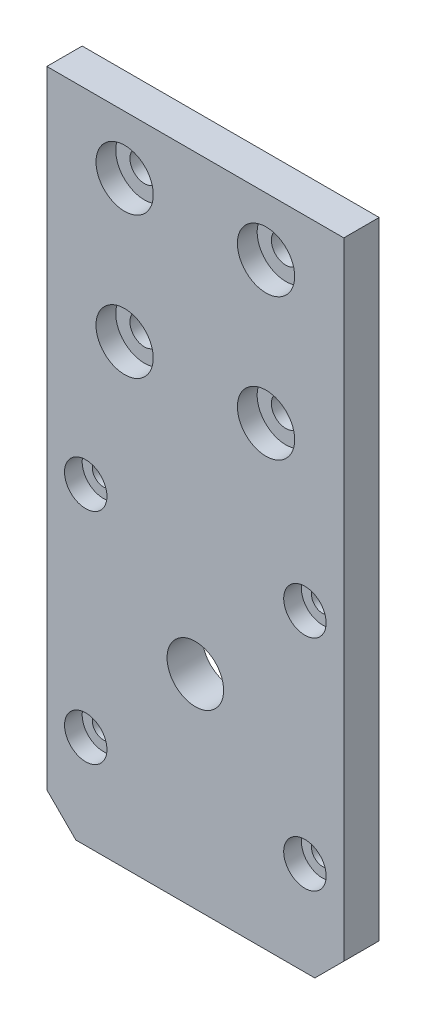
ISO-10303-21;
HEADER;
FILE_DESCRIPTION(('STEP AP214'),'2;1');
FILE_NAME('part.step','',(''),(''),'','','');
FILE_SCHEMA(('AUTOMOTIVE_DESIGN { 1 0 10303 214 1 1 1 1 }'));
ENDSEC;
DATA;
#1=APPLICATION_CONTEXT('core data for automotive mechanical design processes');
#2=APPLICATION_PROTOCOL_DEFINITION('international standard','automotive_design',2000,#1);
#3=PRODUCT_CONTEXT('',#1,'mechanical');
#4=PRODUCT('Part','Part','',(#3));
#5=PRODUCT_RELATED_PRODUCT_CATEGORY('part','',(#4));
#6=PRODUCT_DEFINITION_FORMATION('','',#4);
#7=PRODUCT_DEFINITION_CONTEXT('part definition',#1,'design');
#8=PRODUCT_DEFINITION('design','',#6,#7);
#9=PRODUCT_DEFINITION_SHAPE('','',#8);
#10=(LENGTH_UNIT() NAMED_UNIT(*) SI_UNIT(.MILLI.,.METRE.));
#11=(NAMED_UNIT(*) PLANE_ANGLE_UNIT() SI_UNIT($,.RADIAN.));
#12=(NAMED_UNIT(*) SI_UNIT($,.STERADIAN.) SOLID_ANGLE_UNIT());
#13=UNCERTAINTY_MEASURE_WITH_UNIT(LENGTH_MEASURE(1.E-05),#10,'distance_accuracy_value','');
#14=(GEOMETRIC_REPRESENTATION_CONTEXT(3) GLOBAL_UNCERTAINTY_ASSIGNED_CONTEXT((#13)) GLOBAL_UNIT_ASSIGNED_CONTEXT((#10,
#11,#12)) REPRESENTATION_CONTEXT('',''));
#15=CARTESIAN_POINT('',(0.,0.,0.));
#16=DIRECTION('',(0.,0.,1.));
#17=DIRECTION('',(1.,0.,0.));
#18=AXIS2_PLACEMENT_3D('',#15,#16,#17);
#19=CARTESIAN_POINT('',(5.50000000000001,5.58,0.));
#20=DIRECTION('',(0.,0.,1.));
#21=DIRECTION('',(1.,0.,0.));
#22=AXIS2_PLACEMENT_3D('',#19,#20,#21);
#23=CYLINDRICAL_SURFACE('',#22,1.575);
#24=CARTESIAN_POINT('',(5.50000000000001,5.58,0.));
#25=DIRECTION('',(0.,0.,1.));
#26=DIRECTION('',(1.,0.,0.));
#27=AXIS2_PLACEMENT_3D('',#24,#25,#26);
#28=CIRCLE('',#27,1.575);
#29=CARTESIAN_POINT('',(7.07500000000001,5.58,0.));
#30=VERTEX_POINT('',#29);
#31=EDGE_CURVE('E225',#30,#30,#28,.T.);
#32=ORIENTED_EDGE('',*,*,#31,.F.);
#33=EDGE_LOOP('',(#32));
#34=FACE_BOUND('',#33,.T.);
#35=CARTESIAN_POINT('',(5.50000000000001,5.58,2.5));
#36=DIRECTION('',(0.,0.,1.));
#37=DIRECTION('',(1.,0.,0.));
#38=AXIS2_PLACEMENT_3D('',#35,#36,#37);
#39=CIRCLE('',#38,1.575);
#40=CARTESIAN_POINT('',(7.07500000000001,5.58,2.5));
#41=VERTEX_POINT('',#40);
#42=EDGE_CURVE('E155',#41,#41,#39,.F.);
#43=ORIENTED_EDGE('',*,*,#42,.F.);
#44=EDGE_LOOP('',(#43));
#45=FACE_BOUND('',#44,.T.);
#46=ADVANCED_FACE('F35',(#34,#45),#23,.F.);
#47=CARTESIAN_POINT('',(36.5,5.58000000000001,0.));
#48=DIRECTION('',(0.,0.,1.));
#49=DIRECTION('',(1.,0.,0.));
#50=AXIS2_PLACEMENT_3D('',#47,#48,#49);
#51=CYLINDRICAL_SURFACE('',#50,1.575);
#52=CARTESIAN_POINT('',(36.5,5.58000000000001,0.));
#53=DIRECTION('',(0.,0.,1.));
#54=DIRECTION('',(1.,0.,0.));
#55=AXIS2_PLACEMENT_3D('',#52,#53,#54);
#56=CIRCLE('',#55,1.575);
#57=CARTESIAN_POINT('',(38.075,5.58000000000001,0.));
#58=VERTEX_POINT('',#57);
#59=EDGE_CURVE('E222',#58,#58,#56,.T.);
#60=ORIENTED_EDGE('',*,*,#59,.F.);
#61=EDGE_LOOP('',(#60));
#62=FACE_BOUND('',#61,.T.);
#63=CARTESIAN_POINT('',(36.5,5.58000000000001,2.5));
#64=DIRECTION('',(0.,0.,1.));
#65=DIRECTION('',(1.,0.,0.));
#66=AXIS2_PLACEMENT_3D('',#63,#64,#65);
#67=CIRCLE('',#66,1.575);
#68=CARTESIAN_POINT('',(38.075,5.58000000000001,2.5));
#69=VERTEX_POINT('',#68);
#70=EDGE_CURVE('E150',#69,#69,#67,.F.);
#71=ORIENTED_EDGE('',*,*,#70,.F.);
#72=EDGE_LOOP('',(#71));
#73=FACE_BOUND('',#72,.T.);
#74=ADVANCED_FACE('F296',(#62,#73),#51,.F.);
#75=CARTESIAN_POINT('',(36.5,36.58,0.));
#76=DIRECTION('',(0.,0.,1.));
#77=DIRECTION('',(1.,0.,0.));
#78=AXIS2_PLACEMENT_3D('',#75,#76,#77);
#79=CYLINDRICAL_SURFACE('',#78,1.575);
#80=CARTESIAN_POINT('',(36.5,36.58,0.));
#81=DIRECTION('',(0.,0.,1.));
#82=DIRECTION('',(1.,0.,0.));
#83=AXIS2_PLACEMENT_3D('',#80,#81,#82);
#84=CIRCLE('',#83,1.575);
#85=CARTESIAN_POINT('',(38.075,36.58,0.));
#86=VERTEX_POINT('',#85);
#87=EDGE_CURVE('E219',#86,#86,#84,.T.);
#88=ORIENTED_EDGE('',*,*,#87,.F.);
#89=EDGE_LOOP('',(#88));
#90=FACE_BOUND('',#89,.T.);
#91=CARTESIAN_POINT('',(36.5,36.58,2.5));
#92=DIRECTION('',(0.,0.,1.));
#93=DIRECTION('',(1.,0.,0.));
#94=AXIS2_PLACEMENT_3D('',#91,#92,#93);
#95=CIRCLE('',#94,1.575);
#96=CARTESIAN_POINT('',(38.075,36.58,2.5));
#97=VERTEX_POINT('',#96);
#98=EDGE_CURVE('E145',#97,#97,#95,.F.);
#99=ORIENTED_EDGE('',*,*,#98,.F.);
#100=EDGE_LOOP('',(#99));
#101=FACE_BOUND('',#100,.T.);
#102=ADVANCED_FACE('F302',(#90,#101),#79,.F.);
#103=CARTESIAN_POINT('',(5.5,36.58,0.));
#104=DIRECTION('',(0.,0.,1.));
#105=DIRECTION('',(1.,0.,0.));
#106=AXIS2_PLACEMENT_3D('',#103,#104,#105);
#107=CYLINDRICAL_SURFACE('',#106,1.575);
#108=CARTESIAN_POINT('',(5.5,36.58,0.));
#109=DIRECTION('',(0.,0.,1.));
#110=DIRECTION('',(1.,0.,0.));
#111=AXIS2_PLACEMENT_3D('',#108,#109,#110);
#112=CIRCLE('',#111,1.575);
#113=CARTESIAN_POINT('',(7.075,36.58,0.));
#114=VERTEX_POINT('',#113);
#115=EDGE_CURVE('E214',#114,#114,#112,.T.);
#116=ORIENTED_EDGE('',*,*,#115,.F.);
#117=EDGE_LOOP('',(#116));
#118=FACE_BOUND('',#117,.T.);
#119=CARTESIAN_POINT('',(5.5,36.58,2.5));
#120=DIRECTION('',(0.,0.,1.));
#121=DIRECTION('',(1.,0.,0.));
#122=AXIS2_PLACEMENT_3D('',#119,#120,#121);
#123=CIRCLE('',#122,1.575);
#124=CARTESIAN_POINT('',(7.075,36.58,2.5));
#125=VERTEX_POINT('',#124);
#126=EDGE_CURVE('E140',#125,#125,#123,.F.);
#127=ORIENTED_EDGE('',*,*,#126,.F.);
#128=EDGE_LOOP('',(#127));
#129=FACE_BOUND('',#128,.T.);
#130=ADVANCED_FACE('F313',(#118,#129),#107,.F.);
#131=CARTESIAN_POINT('',(31.,76.8,5.));
#132=DIRECTION('',(0.,0.,-1.));
#133=DIRECTION('',(-1.,0.,0.));
#134=AXIS2_PLACEMENT_3D('',#131,#132,#133);
#135=CYLINDRICAL_SURFACE('',#134,2.04999999999999);
#136=CARTESIAN_POINT('',(31.,76.8,0.));
#137=DIRECTION('',(0.,0.,1.));
#138=DIRECTION('',(1.,0.,0.));
#139=AXIS2_PLACEMENT_3D('',#136,#137,#138);
#140=CIRCLE('',#139,2.04999999999999);
#141=CARTESIAN_POINT('',(33.05,76.8,0.));
#142=VERTEX_POINT('',#141);
#143=EDGE_CURVE('E191',#142,#142,#140,.T.);
#144=ORIENTED_EDGE('',*,*,#143,.F.);
#145=EDGE_LOOP('',(#144));
#146=FACE_BOUND('',#145,.T.);
#147=CARTESIAN_POINT('',(31.,76.8,2.2));
#148=DIRECTION('',(0.,0.,1.));
#149=DIRECTION('',(1.,0.,0.));
#150=AXIS2_PLACEMENT_3D('',#147,#148,#149);
#151=CIRCLE('',#150,2.04999999999999);
#152=CARTESIAN_POINT('',(33.05,76.8,2.2));
#153=VERTEX_POINT('',#152);
#154=EDGE_CURVE('E135',#153,#153,#151,.T.);
#155=ORIENTED_EDGE('',*,*,#154,.T.);
#156=EDGE_LOOP('',(#155));
#157=FACE_BOUND('',#156,.T.);
#158=ADVANCED_FACE('F317',(#146,#157),#135,.F.);
#159=CARTESIAN_POINT('',(31.,56.8,5.));
#160=DIRECTION('',(0.,0.,-1.));
#161=DIRECTION('',(-1.,0.,0.));
#162=AXIS2_PLACEMENT_3D('',#159,#160,#161);
#163=CYLINDRICAL_SURFACE('',#162,2.04999999999999);
#164=CARTESIAN_POINT('',(31.,56.8,0.));
#165=DIRECTION('',(0.,0.,1.));
#166=DIRECTION('',(1.,0.,0.));
#167=AXIS2_PLACEMENT_3D('',#164,#165,#166);
#168=CIRCLE('',#167,2.04999999999999);
#169=CARTESIAN_POINT('',(33.05,56.8,0.));
#170=VERTEX_POINT('',#169);
#171=EDGE_CURVE('E194',#170,#170,#168,.T.);
#172=ORIENTED_EDGE('',*,*,#171,.F.);
#173=EDGE_LOOP('',(#172));
#174=FACE_BOUND('',#173,.T.);
#175=CARTESIAN_POINT('',(31.,56.8,2.2));
#176=DIRECTION('',(0.,0.,1.));
#177=DIRECTION('',(1.,0.,0.));
#178=AXIS2_PLACEMENT_3D('',#175,#176,#177);
#179=CIRCLE('',#178,2.04999999999999);
#180=CARTESIAN_POINT('',(33.05,56.8,2.2));
#181=VERTEX_POINT('',#180);
#182=EDGE_CURVE('E130',#181,#181,#179,.T.);
#183=ORIENTED_EDGE('',*,*,#182,.T.);
#184=EDGE_LOOP('',(#183));
#185=FACE_BOUND('',#184,.T.);
#186=ADVANCED_FACE('F560',(#174,#185),#163,.F.);
#187=CARTESIAN_POINT('',(11.,56.8,5.));
#188=DIRECTION('',(0.,0.,-1.));
#189=DIRECTION('',(-1.,0.,0.));
#190=AXIS2_PLACEMENT_3D('',#187,#188,#189);
#191=CYLINDRICAL_SURFACE('',#190,2.05000000000001);
#192=CARTESIAN_POINT('',(11.,56.8,0.));
#193=DIRECTION('',(0.,0.,1.));
#194=DIRECTION('',(1.,0.,0.));
#195=AXIS2_PLACEMENT_3D('',#192,#193,#194);
#196=CIRCLE('',#195,2.05000000000001);
#197=CARTESIAN_POINT('',(13.05,56.8,0.));
#198=VERTEX_POINT('',#197);
#199=EDGE_CURVE('E123',#198,#198,#196,.T.);
#200=ORIENTED_EDGE('',*,*,#199,.F.);
#201=EDGE_LOOP('',(#200));
#202=FACE_BOUND('',#201,.T.);
#203=CARTESIAN_POINT('',(11.,56.8,2.2));
#204=DIRECTION('',(0.,0.,1.));
#205=DIRECTION('',(1.,0.,0.));
#206=AXIS2_PLACEMENT_3D('',#203,#204,#205);
#207=CIRCLE('',#206,2.05000000000001);
#208=CARTESIAN_POINT('',(13.05,56.8,2.2));
#209=VERTEX_POINT('',#208);
#210=EDGE_CURVE('E125',#209,#209,#207,.T.);
#211=ORIENTED_EDGE('',*,*,#210,.T.);
#212=EDGE_LOOP('',(#211));
#213=FACE_BOUND('',#212,.T.);
#214=ADVANCED_FACE('F570',(#202,#213),#191,.F.);
#215=CARTESIAN_POINT('',(11.,76.8,5.));
#216=DIRECTION('',(0.,0.,-1.));
#217=DIRECTION('',(-1.,0.,0.));
#218=AXIS2_PLACEMENT_3D('',#215,#216,#217);
#219=CYLINDRICAL_SURFACE('',#218,2.04999999999999);
#220=CARTESIAN_POINT('',(11.,76.8,0.));
#221=DIRECTION('',(0.,0.,1.));
#222=DIRECTION('',(1.,0.,0.));
#223=AXIS2_PLACEMENT_3D('',#220,#221,#222);
#224=CIRCLE('',#223,2.04999999999999);
#225=CARTESIAN_POINT('',(13.05,76.8,0.));
#226=VERTEX_POINT('',#225);
#227=EDGE_CURVE('E116',#226,#226,#224,.T.);
#228=ORIENTED_EDGE('',*,*,#227,.F.);
#229=EDGE_LOOP('',(#228));
#230=FACE_BOUND('',#229,.T.);
#231=CARTESIAN_POINT('',(11.,76.8,2.2));
#232=DIRECTION('',(0.,0.,1.));
#233=DIRECTION('',(1.,0.,0.));
#234=AXIS2_PLACEMENT_3D('',#231,#232,#233);
#235=CIRCLE('',#234,2.04999999999999);
#236=CARTESIAN_POINT('',(13.05,76.8,2.2));
#237=VERTEX_POINT('',#236);
#238=EDGE_CURVE('E120',#237,#237,#235,.T.);
#239=ORIENTED_EDGE('',*,*,#238,.T.);
#240=EDGE_LOOP('',(#239));
#241=FACE_BOUND('',#240,.T.);
#242=ADVANCED_FACE('F262',(#230,#241),#219,.F.);
#243=CARTESIAN_POINT('',(0.,0.,5.));
#244=DIRECTION('',(0.,0.,1.));
#245=DIRECTION('',(1.,0.,0.));
#246=AXIS2_PLACEMENT_3D('',#243,#244,#245);
#247=PLANE('',#246);
#248=CARTESIAN_POINT('',(5.50000000000001,5.58,5.));
#249=DIRECTION('',(0.,0.,1.));
#250=DIRECTION('',(1.,0.,0.));
#251=AXIS2_PLACEMENT_3D('',#248,#249,#250);
#252=CIRCLE('',#251,3.);
#253=CARTESIAN_POINT('',(8.50000000000001,5.58,5.));
#254=VERTEX_POINT('',#253);
#255=EDGE_CURVE('E179',#254,#254,#252,.T.);
#256=ORIENTED_EDGE('',*,*,#255,.F.);
#257=EDGE_LOOP('',(#256));
#258=FACE_BOUND('',#257,.T.);
#259=CARTESIAN_POINT('',(36.5,5.58000000000001,5.));
#260=DIRECTION('',(0.,0.,1.));
#261=DIRECTION('',(1.,0.,0.));
#262=AXIS2_PLACEMENT_3D('',#259,#260,#261);
#263=CIRCLE('',#262,3.);
#264=CARTESIAN_POINT('',(39.5,5.58000000000001,5.));
#265=VERTEX_POINT('',#264);
#266=EDGE_CURVE('E158',#265,#265,#263,.T.);
#267=ORIENTED_EDGE('',*,*,#266,.F.);
#268=EDGE_LOOP('',(#267));
#269=FACE_BOUND('',#268,.T.);
#270=CARTESIAN_POINT('',(36.5,36.58,5.));
#271=DIRECTION('',(0.,0.,1.));
#272=DIRECTION('',(1.,0.,0.));
#273=AXIS2_PLACEMENT_3D('',#270,#271,#272);
#274=CIRCLE('',#273,3.);
#275=CARTESIAN_POINT('',(39.5,36.58,5.));
#276=VERTEX_POINT('',#275);
#277=EDGE_CURVE('E153',#276,#276,#274,.T.);
#278=ORIENTED_EDGE('',*,*,#277,.F.);
#279=EDGE_LOOP('',(#278));
#280=FACE_BOUND('',#279,.T.);
#281=CARTESIAN_POINT('',(5.5,36.58,5.));
#282=DIRECTION('',(0.,0.,1.));
#283=DIRECTION('',(1.,0.,0.));
#284=AXIS2_PLACEMENT_3D('',#281,#282,#283);
#285=CIRCLE('',#284,3.);
#286=CARTESIAN_POINT('',(8.5,36.58,5.));
#287=VERTEX_POINT('',#286);
#288=EDGE_CURVE('E148',#287,#287,#285,.T.);
#289=ORIENTED_EDGE('',*,*,#288,.F.);
#290=EDGE_LOOP('',(#289));
#291=FACE_BOUND('',#290,.T.);
#292=CARTESIAN_POINT('',(21.,21.08,5.));
#293=DIRECTION('',(0.,0.,1.));
#294=DIRECTION('',(1.,0.,0.));
#295=AXIS2_PLACEMENT_3D('',#292,#293,#294);
#296=CIRCLE('',#295,4.);
#297=CARTESIAN_POINT('',(25.,21.08,5.));
#298=VERTEX_POINT('',#297);
#299=EDGE_CURVE('E143',#298,#298,#296,.T.);
#300=ORIENTED_EDGE('',*,*,#299,.F.);
#301=EDGE_LOOP('',(#300));
#302=FACE_BOUND('',#301,.T.);
#303=CARTESIAN_POINT('',(31.,76.8,5.));
#304=DIRECTION('',(0.,0.,1.));
#305=DIRECTION('',(1.,0.,0.));
#306=AXIS2_PLACEMENT_3D('',#303,#304,#305);
#307=CIRCLE('',#306,4.04999999999999);
#308=CARTESIAN_POINT('',(35.05,76.8,5.));
#309=VERTEX_POINT('',#308);
#310=EDGE_CURVE('E211',#309,#309,#307,.T.);
#311=ORIENTED_EDGE('',*,*,#310,.F.);
#312=EDGE_LOOP('',(#311));
#313=FACE_BOUND('',#312,.T.);
#314=CARTESIAN_POINT('',(31.,56.8,5.));
#315=DIRECTION('',(0.,0.,1.));
#316=DIRECTION('',(1.,0.,0.));
#317=AXIS2_PLACEMENT_3D('',#314,#315,#316);
#318=CIRCLE('',#317,4.04999999999999);
#319=CARTESIAN_POINT('',(35.05,56.8,5.));
#320=VERTEX_POINT('',#319);
#321=EDGE_CURVE('E138',#320,#320,#318,.T.);
#322=ORIENTED_EDGE('',*,*,#321,.F.);
#323=EDGE_LOOP('',(#322));
#324=FACE_BOUND('',#323,.T.);
#325=CARTESIAN_POINT('',(11.,56.8,5.));
#326=DIRECTION('',(0.,0.,1.));
#327=DIRECTION('',(1.,0.,0.));
#328=AXIS2_PLACEMENT_3D('',#325,#326,#327);
#329=CIRCLE('',#328,4.05);
#330=CARTESIAN_POINT('',(15.05,56.8,5.));
#331=VERTEX_POINT('',#330);
#332=EDGE_CURVE('E133',#331,#331,#329,.T.);
#333=ORIENTED_EDGE('',*,*,#332,.F.);
#334=EDGE_LOOP('',(#333));
#335=FACE_BOUND('',#334,.T.);
#336=CARTESIAN_POINT('',(11.,76.8,5.));
#337=DIRECTION('',(0.,0.,1.));
#338=DIRECTION('',(1.,0.,0.));
#339=AXIS2_PLACEMENT_3D('',#336,#337,#338);
#340=CIRCLE('',#339,4.05);
#341=CARTESIAN_POINT('',(15.05,76.8,5.));
#342=VERTEX_POINT('',#341);
#343=EDGE_CURVE('E128',#342,#342,#340,.T.);
#344=ORIENTED_EDGE('',*,*,#343,.F.);
#345=EDGE_LOOP('',(#344));
#346=FACE_BOUND('',#345,.T.);
#347=DIRECTION('',(0.,-1.,0.));
#348=VECTOR('',#347,1.);
#349=CARTESIAN_POINT('',(0.,85.,5.));
#350=LINE('',#349,#348);
#351=CARTESIAN_POINT('',(0.,85.,5.));
#352=VERTEX_POINT('',#351);
#353=CARTESIAN_POINT('',(0.,-3.59999999999998,5.));
#354=VERTEX_POINT('',#353);
#355=EDGE_CURVE('E96',#352,#354,#350,.T.);
#356=ORIENTED_EDGE('',*,*,#355,.T.);
#357=DIRECTION('',(0.707106781186546,-0.707106781186549,0.));
#358=VECTOR('',#357,1.);
#359=CARTESIAN_POINT('',(-1.79999999999999,-1.79999999999998,5.));
#360=LINE('',#359,#358);
#361=CARTESIAN_POINT('',(4.1,-7.7,5.));
#362=VERTEX_POINT('',#361);
#363=EDGE_CURVE('E43',#354,#362,#360,.T.);
#364=ORIENTED_EDGE('',*,*,#363,.T.);
#365=DIRECTION('',(-1.,0.,0.));
#366=VECTOR('',#365,1.);
#367=CARTESIAN_POINT('',(42.,-7.7,5.));
#368=LINE('',#367,#366);
#369=CARTESIAN_POINT('',(37.9,-7.7,5.));
#370=VERTEX_POINT('',#369);
#371=EDGE_CURVE('E171',#370,#362,#368,.T.);
#372=ORIENTED_EDGE('',*,*,#371,.F.);
#373=DIRECTION('',(0.707106781186548,0.707106781186548,0.));
#374=VECTOR('',#373,1.);
#375=CARTESIAN_POINT('',(22.8,-22.8,5.));
#376=LINE('',#375,#374);
#377=CARTESIAN_POINT('',(42.,-3.59999999999997,5.));
#378=VERTEX_POINT('',#377);
#379=EDGE_CURVE('E50',#370,#378,#376,.T.);
#380=ORIENTED_EDGE('',*,*,#379,.T.);
#381=DIRECTION('',(0.,1.,0.));
#382=VECTOR('',#381,1.);
#383=CARTESIAN_POINT('',(42.,85.,5.));
#384=LINE('',#383,#382);
#385=CARTESIAN_POINT('',(42.,85.,5.));
#386=VERTEX_POINT('',#385);
#387=EDGE_CURVE('E88',#378,#386,#384,.T.);
#388=ORIENTED_EDGE('',*,*,#387,.T.);
#389=DIRECTION('',(-1.,0.,0.));
#390=VECTOR('',#389,1.);
#391=CARTESIAN_POINT('',(0.,85.,5.));
#392=LINE('',#391,#390);
#393=EDGE_CURVE('E92',#386,#352,#392,.T.);
#394=ORIENTED_EDGE('',*,*,#393,.T.);
#395=EDGE_LOOP('',(#356,#364,#372,#380,#388,#394));
#396=FACE_BOUND('',#395,.T.);
#397=ADVANCED_FACE('F90',(#258,#269,#280,#291,#302,#313,#324,#335,#346,#396),#247,.T.);
#398=CARTESIAN_POINT('',(0.,0.,0.));
#399=DIRECTION('',(0.,0.,1.));
#400=DIRECTION('',(1.,0.,0.));
#401=AXIS2_PLACEMENT_3D('',#398,#399,#400);
#402=PLANE('',#401);
#403=CARTESIAN_POINT('',(21.,21.08,0.));
#404=DIRECTION('',(0.,0.,1.));
#405=DIRECTION('',(1.,0.,0.));
#406=AXIS2_PLACEMENT_3D('',#403,#404,#405);
#407=CIRCLE('',#406,4.);
#408=CARTESIAN_POINT('',(25.,21.08,0.));
#409=VERTEX_POINT('',#408);
#410=EDGE_CURVE('E228',#409,#409,#407,.T.);
#411=ORIENTED_EDGE('',*,*,#410,.T.);
#412=EDGE_LOOP('',(#411));
#413=FACE_BOUND('',#412,.T.);
#414=ORIENTED_EDGE('',*,*,#31,.T.);
#415=EDGE_LOOP('',(#414));
#416=FACE_BOUND('',#415,.T.);
#417=ORIENTED_EDGE('',*,*,#59,.T.);
#418=EDGE_LOOP('',(#417));
#419=FACE_BOUND('',#418,.T.);
#420=ORIENTED_EDGE('',*,*,#87,.T.);
#421=EDGE_LOOP('',(#420));
#422=FACE_BOUND('',#421,.T.);
#423=ORIENTED_EDGE('',*,*,#115,.T.);
#424=EDGE_LOOP('',(#423));
#425=FACE_BOUND('',#424,.T.);
#426=DIRECTION('',(-1.,0.,0.));
#427=VECTOR('',#426,1.);
#428=CARTESIAN_POINT('',(42.,-7.7,0.));
#429=LINE('',#428,#427);
#430=CARTESIAN_POINT('',(37.9,-7.7,0.));
#431=VERTEX_POINT('',#430);
#432=CARTESIAN_POINT('',(4.10000000000001,-7.7,0.));
#433=VERTEX_POINT('',#432);
#434=EDGE_CURVE('E180',#431,#433,#429,.T.);
#435=ORIENTED_EDGE('',*,*,#434,.T.);
#436=DIRECTION('',(-0.707106781186546,0.707106781186549,0.));
#437=VECTOR('',#436,1.);
#438=CARTESIAN_POINT('',(4.10000000000001,-7.7,0.));
#439=LINE('',#438,#437);
#440=CARTESIAN_POINT('',(0.,-3.59999999999998,0.));
#441=VERTEX_POINT('',#440);
#442=EDGE_CURVE('E166',#433,#441,#439,.T.);
#443=ORIENTED_EDGE('',*,*,#442,.T.);
#444=DIRECTION('',(0.,-1.,0.));
#445=VECTOR('',#444,1.);
#446=CARTESIAN_POINT('',(0.,85.,0.));
#447=LINE('',#446,#445);
#448=CARTESIAN_POINT('',(0.,85.,0.));
#449=VERTEX_POINT('',#448);
#450=EDGE_CURVE('E114',#449,#441,#447,.T.);
#451=ORIENTED_EDGE('',*,*,#450,.F.);
#452=DIRECTION('',(-1.,0.,0.));
#453=VECTOR('',#452,1.);
#454=CARTESIAN_POINT('',(0.,85.,0.));
#455=LINE('',#454,#453);
#456=CARTESIAN_POINT('',(42.,85.,0.));
#457=VERTEX_POINT('',#456);
#458=EDGE_CURVE('E118',#457,#449,#455,.T.);
#459=ORIENTED_EDGE('',*,*,#458,.F.);
#460=DIRECTION('',(0.,1.,0.));
#461=VECTOR('',#460,1.);
#462=CARTESIAN_POINT('',(42.,85.,0.));
#463=LINE('',#462,#461);
#464=CARTESIAN_POINT('',(42.,-3.59999999999997,0.));
#465=VERTEX_POINT('',#464);
#466=EDGE_CURVE('E102',#465,#457,#463,.T.);
#467=ORIENTED_EDGE('',*,*,#466,.F.);
#468=DIRECTION('',(-0.707106781186548,-0.707106781186548,0.));
#469=VECTOR('',#468,1.);
#470=CARTESIAN_POINT('',(42.,-3.59999999999999,0.));
#471=LINE('',#470,#469);
#472=EDGE_CURVE('E164',#465,#431,#471,.T.);
#473=ORIENTED_EDGE('',*,*,#472,.T.);
#474=EDGE_LOOP('',(#435,#443,#451,#459,#467,#473));
#475=FACE_BOUND('',#474,.T.);
#476=ORIENTED_EDGE('',*,*,#227,.T.);
#477=EDGE_LOOP('',(#476));
#478=FACE_BOUND('',#477,.T.);
#479=ORIENTED_EDGE('',*,*,#143,.T.);
#480=EDGE_LOOP('',(#479));
#481=FACE_BOUND('',#480,.T.);
#482=ORIENTED_EDGE('',*,*,#171,.T.);
#483=EDGE_LOOP('',(#482));
#484=FACE_BOUND('',#483,.T.);
#485=ORIENTED_EDGE('',*,*,#199,.T.);
#486=EDGE_LOOP('',(#485));
#487=FACE_BOUND('',#486,.T.);
#488=ADVANCED_FACE('F185',(#413,#416,#419,#422,#425,#475,#478,#481,#484,#487),#402,.F.);
#489=CARTESIAN_POINT('',(0.,85.,5.));
#490=DIRECTION('',(1.,0.,0.));
#491=DIRECTION('',(0.,1.,0.));
#492=AXIS2_PLACEMENT_3D('',#489,#490,#491);
#493=PLANE('',#492);
#494=ORIENTED_EDGE('',*,*,#450,.T.);
#495=DIRECTION('',(0.,0.,1.));
#496=VECTOR('',#495,1.);
#497=CARTESIAN_POINT('',(0.,-3.59999999999998,5.));
#498=LINE('',#497,#496);
#499=EDGE_CURVE('E58',#441,#354,#498,.T.);
#500=ORIENTED_EDGE('',*,*,#499,.T.);
#501=ORIENTED_EDGE('',*,*,#355,.F.);
#502=DIRECTION('',(0.,0.,-1.));
#503=VECTOR('',#502,1.);
#504=CARTESIAN_POINT('',(0.,85.,5.));
#505=LINE('',#504,#503);
#506=EDGE_CURVE('E106',#352,#449,#505,.T.);
#507=ORIENTED_EDGE('',*,*,#506,.T.);
#508=EDGE_LOOP('',(#494,#500,#501,#507));
#509=FACE_BOUND('',#508,.T.);
#510=ADVANCED_FACE('F187',(#509),#493,.F.);
#511=CARTESIAN_POINT('',(42.,85.,5.));
#512=DIRECTION('',(-1.,0.,0.));
#513=DIRECTION('',(0.,0.,1.));
#514=AXIS2_PLACEMENT_3D('',#511,#512,#513);
#515=PLANE('',#514);
#516=ORIENTED_EDGE('',*,*,#387,.F.);
#517=DIRECTION('',(0.,0.,-1.));
#518=VECTOR('',#517,1.);
#519=CARTESIAN_POINT('',(42.,-3.59999999999999,0.));
#520=LINE('',#519,#518);
#521=EDGE_CURVE('E11',#378,#465,#520,.T.);
#522=ORIENTED_EDGE('',*,*,#521,.T.);
#523=ORIENTED_EDGE('',*,*,#466,.T.);
#524=DIRECTION('',(0.,0.,-1.));
#525=VECTOR('',#524,1.);
#526=CARTESIAN_POINT('',(42.,85.,5.));
#527=LINE('',#526,#525);
#528=EDGE_CURVE('E99',#386,#457,#527,.T.);
#529=ORIENTED_EDGE('',*,*,#528,.F.);
#530=EDGE_LOOP('',(#516,#522,#523,#529));
#531=FACE_BOUND('',#530,.T.);
#532=ADVANCED_FACE('F100',(#531),#515,.F.);
#533=CARTESIAN_POINT('',(0.,85.,5.));
#534=DIRECTION('',(0.,-1.,0.));
#535=DIRECTION('',(0.,0.,-1.));
#536=AXIS2_PLACEMENT_3D('',#533,#534,#535);
#537=PLANE('',#536);
#538=ORIENTED_EDGE('',*,*,#458,.T.);
#539=ORIENTED_EDGE('',*,*,#506,.F.);
#540=ORIENTED_EDGE('',*,*,#393,.F.);
#541=ORIENTED_EDGE('',*,*,#528,.T.);
#542=EDGE_LOOP('',(#538,#539,#540,#541));
#543=FACE_BOUND('',#542,.T.);
#544=ADVANCED_FACE('F108',(#543),#537,.F.);
#545=CARTESIAN_POINT('',(11.,76.8,2.2));
#546=DIRECTION('',(0.,0.,1.));
#547=DIRECTION('',(1.,0.,0.));
#548=AXIS2_PLACEMENT_3D('',#545,#546,#547);
#549=CYLINDRICAL_SURFACE('',#548,4.05);
#550=CARTESIAN_POINT('',(11.,76.8,2.2));
#551=DIRECTION('',(0.,0.,1.));
#552=DIRECTION('',(1.,0.,0.));
#553=AXIS2_PLACEMENT_3D('',#550,#551,#552);
#554=CIRCLE('',#553,4.05);
#555=CARTESIAN_POINT('',(15.05,76.8,2.2));
#556=VERTEX_POINT('',#555);
#557=EDGE_CURVE('E124',#556,#556,#554,.T.);
#558=ORIENTED_EDGE('',*,*,#557,.F.);
#559=EDGE_LOOP('',(#558));
#560=FACE_BOUND('',#559,.T.);
#561=ORIENTED_EDGE('',*,*,#343,.T.);
#562=EDGE_LOOP('',(#561));
#563=FACE_BOUND('',#562,.T.);
#564=ADVANCED_FACE('F280',(#560,#563),#549,.F.);
#565=CARTESIAN_POINT('',(11.,76.8,2.2));
#566=DIRECTION('',(0.,0.,1.));
#567=DIRECTION('',(1.,0.,0.));
#568=AXIS2_PLACEMENT_3D('',#565,#566,#567);
#569=PLANE('',#568);
#570=ORIENTED_EDGE('',*,*,#238,.F.);
#571=EDGE_LOOP('',(#570));
#572=FACE_BOUND('',#571,.T.);
#573=ORIENTED_EDGE('',*,*,#557,.T.);
#574=EDGE_LOOP('',(#573));
#575=FACE_BOUND('',#574,.T.);
#576=ADVANCED_FACE('F282',(#572,#575),#569,.T.);
#577=CARTESIAN_POINT('',(11.,56.8,2.2));
#578=DIRECTION('',(0.,0.,1.));
#579=DIRECTION('',(1.,0.,0.));
#580=AXIS2_PLACEMENT_3D('',#577,#578,#579);
#581=CYLINDRICAL_SURFACE('',#580,4.05);
#582=CARTESIAN_POINT('',(11.,56.8,2.2));
#583=DIRECTION('',(0.,0.,1.));
#584=DIRECTION('',(1.,0.,0.));
#585=AXIS2_PLACEMENT_3D('',#582,#583,#584);
#586=CIRCLE('',#585,4.05);
#587=CARTESIAN_POINT('',(15.05,56.8,2.2));
#588=VERTEX_POINT('',#587);
#589=EDGE_CURVE('E129',#588,#588,#586,.T.);
#590=ORIENTED_EDGE('',*,*,#589,.F.);
#591=EDGE_LOOP('',(#590));
#592=FACE_BOUND('',#591,.T.);
#593=ORIENTED_EDGE('',*,*,#332,.T.);
#594=EDGE_LOOP('',(#593));
#595=FACE_BOUND('',#594,.T.);
#596=ADVANCED_FACE('F289',(#592,#595),#581,.F.);
#597=CARTESIAN_POINT('',(11.,56.8,2.2));
#598=DIRECTION('',(0.,0.,1.));
#599=DIRECTION('',(1.,0.,0.));
#600=AXIS2_PLACEMENT_3D('',#597,#598,#599);
#601=PLANE('',#600);
#602=ORIENTED_EDGE('',*,*,#210,.F.);
#603=EDGE_LOOP('',(#602));
#604=FACE_BOUND('',#603,.T.);
#605=ORIENTED_EDGE('',*,*,#589,.T.);
#606=EDGE_LOOP('',(#605));
#607=FACE_BOUND('',#606,.T.);
#608=ADVANCED_FACE('F334',(#604,#607),#601,.T.);
#609=CARTESIAN_POINT('',(31.,56.8,2.2));
#610=DIRECTION('',(0.,0.,1.));
#611=DIRECTION('',(1.,0.,0.));
#612=AXIS2_PLACEMENT_3D('',#609,#610,#611);
#613=CYLINDRICAL_SURFACE('',#612,4.04999999999999);
#614=CARTESIAN_POINT('',(31.,56.8,2.2));
#615=DIRECTION('',(0.,0.,1.));
#616=DIRECTION('',(1.,0.,0.));
#617=AXIS2_PLACEMENT_3D('',#614,#615,#616);
#618=CIRCLE('',#617,4.04999999999999);
#619=CARTESIAN_POINT('',(35.05,56.8,2.2));
#620=VERTEX_POINT('',#619);
#621=EDGE_CURVE('E134',#620,#620,#618,.T.);
#622=ORIENTED_EDGE('',*,*,#621,.F.);
#623=EDGE_LOOP('',(#622));
#624=FACE_BOUND('',#623,.T.);
#625=ORIENTED_EDGE('',*,*,#321,.T.);
#626=EDGE_LOOP('',(#625));
#627=FACE_BOUND('',#626,.T.);
#628=ADVANCED_FACE('F330',(#624,#627),#613,.F.);
#629=CARTESIAN_POINT('',(31.,56.8,2.2));
#630=DIRECTION('',(0.,0.,1.));
#631=DIRECTION('',(1.,0.,0.));
#632=AXIS2_PLACEMENT_3D('',#629,#630,#631);
#633=PLANE('',#632);
#634=ORIENTED_EDGE('',*,*,#182,.F.);
#635=EDGE_LOOP('',(#634));
#636=FACE_BOUND('',#635,.T.);
#637=ORIENTED_EDGE('',*,*,#621,.T.);
#638=EDGE_LOOP('',(#637));
#639=FACE_BOUND('',#638,.T.);
#640=ADVANCED_FACE('F326',(#636,#639),#633,.T.);
#641=CARTESIAN_POINT('',(31.,76.8,2.2));
#642=DIRECTION('',(0.,0.,1.));
#643=DIRECTION('',(1.,0.,0.));
#644=AXIS2_PLACEMENT_3D('',#641,#642,#643);
#645=CYLINDRICAL_SURFACE('',#644,4.04999999999999);
#646=CARTESIAN_POINT('',(31.,76.8,2.2));
#647=DIRECTION('',(0.,0.,1.));
#648=DIRECTION('',(1.,0.,0.));
#649=AXIS2_PLACEMENT_3D('',#646,#647,#648);
#650=CIRCLE('',#649,4.04999999999999);
#651=CARTESIAN_POINT('',(35.05,76.8,2.2));
#652=VERTEX_POINT('',#651);
#653=EDGE_CURVE('E139',#652,#652,#650,.T.);
#654=ORIENTED_EDGE('',*,*,#653,.F.);
#655=EDGE_LOOP('',(#654));
#656=FACE_BOUND('',#655,.T.);
#657=ORIENTED_EDGE('',*,*,#310,.T.);
#658=EDGE_LOOP('',(#657));
#659=FACE_BOUND('',#658,.T.);
#660=ADVANCED_FACE('F322',(#656,#659),#645,.F.);
#661=CARTESIAN_POINT('',(31.,76.8,2.2));
#662=DIRECTION('',(0.,0.,1.));
#663=DIRECTION('',(1.,0.,0.));
#664=AXIS2_PLACEMENT_3D('',#661,#662,#663);
#665=PLANE('',#664);
#666=ORIENTED_EDGE('',*,*,#154,.F.);
#667=EDGE_LOOP('',(#666));
#668=FACE_BOUND('',#667,.T.);
#669=ORIENTED_EDGE('',*,*,#653,.T.);
#670=EDGE_LOOP('',(#669));
#671=FACE_BOUND('',#670,.T.);
#672=ADVANCED_FACE('F319',(#668,#671),#665,.T.);
#673=CARTESIAN_POINT('',(21.,21.08,0.));
#674=DIRECTION('',(0.,0.,1.));
#675=DIRECTION('',(1.,0.,0.));
#676=AXIS2_PLACEMENT_3D('',#673,#674,#675);
#677=CYLINDRICAL_SURFACE('',#676,4.);
#678=ORIENTED_EDGE('',*,*,#410,.F.);
#679=EDGE_LOOP('',(#678));
#680=FACE_BOUND('',#679,.T.);
#681=ORIENTED_EDGE('',*,*,#299,.T.);
#682=EDGE_LOOP('',(#681));
#683=FACE_BOUND('',#682,.T.);
#684=ADVANCED_FACE('F308',(#680,#683),#677,.F.);
#685=CARTESIAN_POINT('',(5.5,36.58,2.5));
#686=DIRECTION('',(0.,0.,1.));
#687=DIRECTION('',(1.,0.,0.));
#688=AXIS2_PLACEMENT_3D('',#685,#686,#687);
#689=PLANE('',#688);
#690=CARTESIAN_POINT('',(5.5,36.58,2.5));
#691=DIRECTION('',(0.,0.,1.));
#692=DIRECTION('',(1.,0.,0.));
#693=AXIS2_PLACEMENT_3D('',#690,#691,#692);
#694=CIRCLE('',#693,3.);
#695=CARTESIAN_POINT('',(8.5,36.58,2.5));
#696=VERTEX_POINT('',#695);
#697=EDGE_CURVE('E144',#696,#696,#694,.T.);
#698=ORIENTED_EDGE('',*,*,#697,.T.);
#699=EDGE_LOOP('',(#698));
#700=FACE_BOUND('',#699,.T.);
#701=ORIENTED_EDGE('',*,*,#126,.T.);
#702=EDGE_LOOP('',(#701));
#703=FACE_BOUND('',#702,.T.);
#704=ADVANCED_FACE('F374',(#700,#703),#689,.T.);
#705=CARTESIAN_POINT('',(5.5,36.58,2.5));
#706=DIRECTION('',(0.,0.,1.));
#707=DIRECTION('',(1.,0.,0.));
#708=AXIS2_PLACEMENT_3D('',#705,#706,#707);
#709=CYLINDRICAL_SURFACE('',#708,3.);
#710=ORIENTED_EDGE('',*,*,#697,.F.);
#711=EDGE_LOOP('',(#710));
#712=FACE_BOUND('',#711,.T.);
#713=ORIENTED_EDGE('',*,*,#288,.T.);
#714=EDGE_LOOP('',(#713));
#715=FACE_BOUND('',#714,.T.);
#716=ADVANCED_FACE('F381',(#712,#715),#709,.F.);
#717=CARTESIAN_POINT('',(36.5,36.58,2.5));
#718=DIRECTION('',(0.,0.,1.));
#719=DIRECTION('',(1.,0.,0.));
#720=AXIS2_PLACEMENT_3D('',#717,#718,#719);
#721=PLANE('',#720);
#722=CARTESIAN_POINT('',(36.5,36.58,2.5));
#723=DIRECTION('',(0.,0.,1.));
#724=DIRECTION('',(1.,0.,0.));
#725=AXIS2_PLACEMENT_3D('',#722,#723,#724);
#726=CIRCLE('',#725,3.);
#727=CARTESIAN_POINT('',(39.5,36.58,2.5));
#728=VERTEX_POINT('',#727);
#729=EDGE_CURVE('E149',#728,#728,#726,.T.);
#730=ORIENTED_EDGE('',*,*,#729,.T.);
#731=EDGE_LOOP('',(#730));
#732=FACE_BOUND('',#731,.T.);
#733=ORIENTED_EDGE('',*,*,#98,.T.);
#734=EDGE_LOOP('',(#733));
#735=FACE_BOUND('',#734,.T.);
#736=ADVANCED_FACE('F390',(#732,#735),#721,.T.);
#737=CARTESIAN_POINT('',(36.5,36.58,2.5));
#738=DIRECTION('',(0.,0.,1.));
#739=DIRECTION('',(1.,0.,0.));
#740=AXIS2_PLACEMENT_3D('',#737,#738,#739);
#741=CYLINDRICAL_SURFACE('',#740,3.);
#742=ORIENTED_EDGE('',*,*,#729,.F.);
#743=EDGE_LOOP('',(#742));
#744=FACE_BOUND('',#743,.T.);
#745=ORIENTED_EDGE('',*,*,#277,.T.);
#746=EDGE_LOOP('',(#745));
#747=FACE_BOUND('',#746,.T.);
#748=ADVANCED_FACE('F397',(#744,#747),#741,.F.);
#749=CARTESIAN_POINT('',(36.5,5.58000000000001,2.5));
#750=DIRECTION('',(0.,0.,1.));
#751=DIRECTION('',(1.,0.,0.));
#752=AXIS2_PLACEMENT_3D('',#749,#750,#751);
#753=PLANE('',#752);
#754=CARTESIAN_POINT('',(36.5,5.58000000000001,2.5));
#755=DIRECTION('',(0.,0.,1.));
#756=DIRECTION('',(1.,0.,0.));
#757=AXIS2_PLACEMENT_3D('',#754,#755,#756);
#758=CIRCLE('',#757,3.);
#759=CARTESIAN_POINT('',(39.5,5.58000000000001,2.5));
#760=VERTEX_POINT('',#759);
#761=EDGE_CURVE('E154',#760,#760,#758,.T.);
#762=ORIENTED_EDGE('',*,*,#761,.T.);
#763=EDGE_LOOP('',(#762));
#764=FACE_BOUND('',#763,.T.);
#765=ORIENTED_EDGE('',*,*,#70,.T.);
#766=EDGE_LOOP('',(#765));
#767=FACE_BOUND('',#766,.T.);
#768=ADVANCED_FACE('F405',(#764,#767),#753,.T.);
#769=CARTESIAN_POINT('',(36.5,5.58000000000001,2.5));
#770=DIRECTION('',(0.,0.,1.));
#771=DIRECTION('',(1.,0.,0.));
#772=AXIS2_PLACEMENT_3D('',#769,#770,#771);
#773=CYLINDRICAL_SURFACE('',#772,3.);
#774=ORIENTED_EDGE('',*,*,#761,.F.);
#775=EDGE_LOOP('',(#774));
#776=FACE_BOUND('',#775,.T.);
#777=ORIENTED_EDGE('',*,*,#266,.T.);
#778=EDGE_LOOP('',(#777));
#779=FACE_BOUND('',#778,.T.);
#780=ADVANCED_FACE('F413',(#776,#779),#773,.F.);
#781=CARTESIAN_POINT('',(5.50000000000001,5.58,2.5));
#782=DIRECTION('',(0.,0.,1.));
#783=DIRECTION('',(1.,0.,0.));
#784=AXIS2_PLACEMENT_3D('',#781,#782,#783);
#785=PLANE('',#784);
#786=CARTESIAN_POINT('',(5.50000000000001,5.58,2.5));
#787=DIRECTION('',(0.,0.,1.));
#788=DIRECTION('',(1.,0.,0.));
#789=AXIS2_PLACEMENT_3D('',#786,#787,#788);
#790=CIRCLE('',#789,3.);
#791=CARTESIAN_POINT('',(8.50000000000001,5.58,2.5));
#792=VERTEX_POINT('',#791);
#793=EDGE_CURVE('E159',#792,#792,#790,.T.);
#794=ORIENTED_EDGE('',*,*,#793,.T.);
#795=EDGE_LOOP('',(#794));
#796=FACE_BOUND('',#795,.T.);
#797=ORIENTED_EDGE('',*,*,#42,.T.);
#798=EDGE_LOOP('',(#797));
#799=FACE_BOUND('',#798,.T.);
#800=ADVANCED_FACE('F251',(#796,#799),#785,.T.);
#801=CARTESIAN_POINT('',(5.50000000000001,5.58,2.5));
#802=DIRECTION('',(0.,0.,1.));
#803=DIRECTION('',(1.,0.,0.));
#804=AXIS2_PLACEMENT_3D('',#801,#802,#803);
#805=CYLINDRICAL_SURFACE('',#804,3.);
#806=ORIENTED_EDGE('',*,*,#793,.F.);
#807=EDGE_LOOP('',(#806));
#808=FACE_BOUND('',#807,.T.);
#809=ORIENTED_EDGE('',*,*,#255,.T.);
#810=EDGE_LOOP('',(#809));
#811=FACE_BOUND('',#810,.T.);
#812=ADVANCED_FACE('F254',(#808,#811),#805,.F.);
#813=CARTESIAN_POINT('',(42.,-7.7,5.));
#814=DIRECTION('',(0.,-1.,0.));
#815=DIRECTION('',(0.,0.,-1.));
#816=AXIS2_PLACEMENT_3D('',#813,#814,#815);
#817=PLANE('',#816);
#818=ORIENTED_EDGE('',*,*,#371,.T.);
#819=DIRECTION('',(0.,0.,-1.));
#820=VECTOR('',#819,1.);
#821=CARTESIAN_POINT('',(4.10000000000001,-7.7,0.));
#822=LINE('',#821,#820);
#823=EDGE_CURVE('E161',#362,#433,#822,.T.);
#824=ORIENTED_EDGE('',*,*,#823,.T.);
#825=ORIENTED_EDGE('',*,*,#434,.F.);
#826=DIRECTION('',(0.,0.,1.));
#827=VECTOR('',#826,1.);
#828=CARTESIAN_POINT('',(37.9,-7.7,5.));
#829=LINE('',#828,#827);
#830=EDGE_CURVE('E105',#431,#370,#829,.T.);
#831=ORIENTED_EDGE('',*,*,#830,.T.);
#832=EDGE_LOOP('',(#818,#824,#825,#831));
#833=FACE_BOUND('',#832,.T.);
#834=ADVANCED_FACE('F175',(#833),#817,.T.);
#835=CARTESIAN_POINT('',(4.10000000000001,-7.7,5.));
#836=DIRECTION('',(-0.707106781186549,-0.707106781186546,0.));
#837=DIRECTION('',(0.,0.,1.));
#838=AXIS2_PLACEMENT_3D('',#835,#836,#837);
#839=PLANE('',#838);
#840=ORIENTED_EDGE('',*,*,#363,.F.);
#841=ORIENTED_EDGE('',*,*,#499,.F.);
#842=ORIENTED_EDGE('',*,*,#442,.F.);
#843=ORIENTED_EDGE('',*,*,#823,.F.);
#844=EDGE_LOOP('',(#840,#841,#842,#843));
#845=FACE_BOUND('',#844,.T.);
#846=ADVANCED_FACE('F182',(#845),#839,.T.);
#847=CARTESIAN_POINT('',(42.,-3.59999999999999,5.));
#848=DIRECTION('',(0.707106781186547,-0.707106781186547,0.));
#849=DIRECTION('',(0.,0.,1.));
#850=AXIS2_PLACEMENT_3D('',#847,#848,#849);
#851=PLANE('',#850);
#852=ORIENTED_EDGE('',*,*,#379,.F.);
#853=ORIENTED_EDGE('',*,*,#830,.F.);
#854=ORIENTED_EDGE('',*,*,#472,.F.);
#855=ORIENTED_EDGE('',*,*,#521,.F.);
#856=EDGE_LOOP('',(#852,#853,#854,#855));
#857=FACE_BOUND('',#856,.T.);
#858=ADVANCED_FACE('F37',(#857),#851,.T.);
#859=CLOSED_SHELL('',(#46,#74,#102,#130,#158,#186,#214,#242,#397,#488,#510,#532,#544,#564,#576,
#596,#608,#628,#640,#660,#672,#684,#704,#716,#736,#748,#768,#780,#800,#812,#834,#846,#858));
#860=MANIFOLD_SOLID_BREP('B2',#859);
#861=ADVANCED_BREP_SHAPE_REPRESENTATION('',(#18,#860),#14);
#862=SHAPE_DEFINITION_REPRESENTATION(#9,#861);
ENDSEC;
END-ISO-10303-21;
